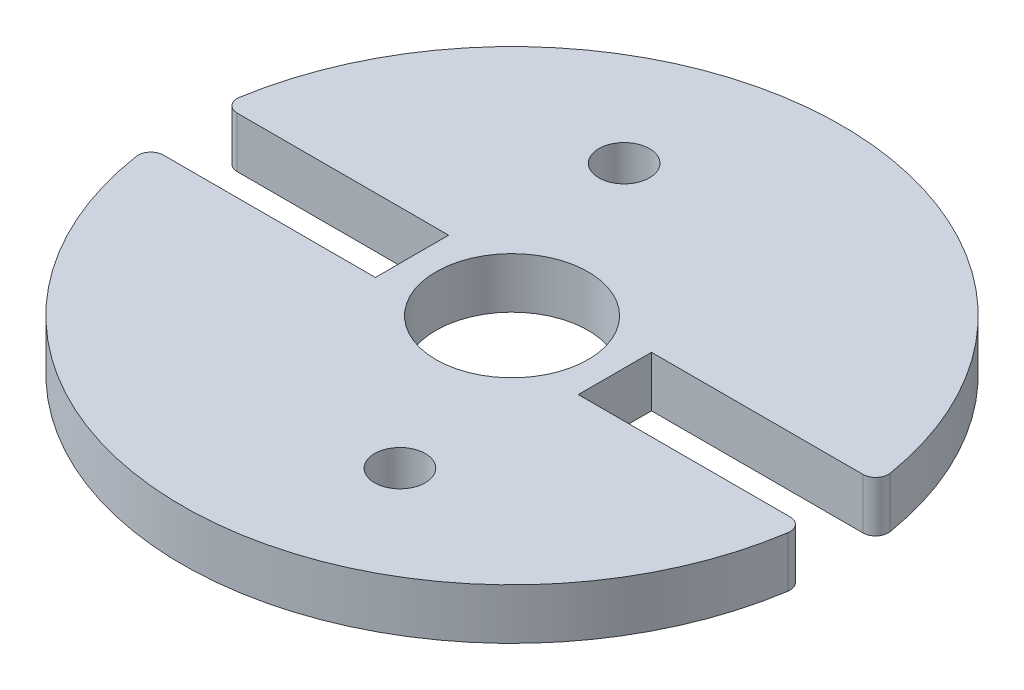
ISO-10303-21;
HEADER;
FILE_DESCRIPTION(('STEP AP214'),'2;1');
FILE_NAME('part.step','',(''),(''),'','','');
FILE_SCHEMA(('AUTOMOTIVE_DESIGN { 1 0 10303 214 1 1 1 1 }'));
ENDSEC;
DATA;
#1=APPLICATION_CONTEXT('core data for automotive mechanical design processes');
#2=APPLICATION_PROTOCOL_DEFINITION('international standard','automotive_design',2000,#1);
#3=PRODUCT_CONTEXT('',#1,'mechanical');
#4=PRODUCT('Part','Part','',(#3));
#5=PRODUCT_RELATED_PRODUCT_CATEGORY('part','',(#4));
#6=PRODUCT_DEFINITION_FORMATION('','',#4);
#7=PRODUCT_DEFINITION_CONTEXT('part definition',#1,'design');
#8=PRODUCT_DEFINITION('design','',#6,#7);
#9=PRODUCT_DEFINITION_SHAPE('','',#8);
#10=(LENGTH_UNIT() NAMED_UNIT(*) SI_UNIT(.MILLI.,.METRE.));
#11=(NAMED_UNIT(*) PLANE_ANGLE_UNIT() SI_UNIT($,.RADIAN.));
#12=(NAMED_UNIT(*) SI_UNIT($,.STERADIAN.) SOLID_ANGLE_UNIT());
#13=UNCERTAINTY_MEASURE_WITH_UNIT(LENGTH_MEASURE(1.E-05),#10,'distance_accuracy_value','');
#14=(GEOMETRIC_REPRESENTATION_CONTEXT(3) GLOBAL_UNCERTAINTY_ASSIGNED_CONTEXT((#13)) GLOBAL_UNIT_ASSIGNED_CONTEXT((#10,
#11,#12)) REPRESENTATION_CONTEXT('',''));
#15=CARTESIAN_POINT('',(0.,0.,0.));
#16=DIRECTION('',(0.,0.,1.));
#17=DIRECTION('',(1.,0.,0.));
#18=AXIS2_PLACEMENT_3D('',#15,#16,#17);
#19=CARTESIAN_POINT('',(-12.3565883381929,2.,1.88804783849236));
#20=DIRECTION('',(0.,-1.,0.));
#21=DIRECTION('',(0.,0.,-1.));
#22=AXIS2_PLACEMENT_3D('',#19,#20,#21);
#23=PLANE('',#22);
#24=CARTESIAN_POINT('',(2.99685274732746,2.,7.41747083653423));
#25=DIRECTION('',(0.,1.,0.));
#26=DIRECTION('',(0.,0.,-1.));
#27=AXIS2_PLACEMENT_3D('',#24,#25,#26);
#28=CIRCLE('',#27,1.);
#29=CARTESIAN_POINT('',(2.99685274732746,2.,6.41747083653423));
#30=VERTEX_POINT('',#29);
#31=EDGE_CURVE('E287',#30,#30,#28,.T.);
#32=ORIENTED_EDGE('',*,*,#31,.F.);
#33=EDGE_LOOP('',(#32));
#34=FACE_BOUND('',#33,.T.);
#35=DIRECTION('',(0.,0.,1.));
#36=VECTOR('',#35,1.);
#37=CARTESIAN_POINT('',(-4.,2.,-1.5));
#38=LINE('',#37,#36);
#39=CARTESIAN_POINT('',(-4.,2.,-1.5));
#40=VERTEX_POINT('',#39);
#41=CARTESIAN_POINT('',(-4.,2.,1.38804783849236));
#42=VERTEX_POINT('',#41);
#43=EDGE_CURVE('E177',#40,#42,#38,.T.);
#44=ORIENTED_EDGE('',*,*,#43,.T.);
#45=DIRECTION('',(-1.,0.,0.));
#46=VECTOR('',#45,1.);
#47=CARTESIAN_POINT('',(-12.3565883381929,2.,1.38804783849236));
#48=LINE('',#47,#46);
#49=CARTESIAN_POINT('',(-12.3565883381929,2.,1.38804783849236));
#50=VERTEX_POINT('',#49);
#51=EDGE_CURVE('E105',#42,#50,#48,.T.);
#52=ORIENTED_EDGE('',*,*,#51,.T.);
#53=CARTESIAN_POINT('',(-12.3565883381929,2.,1.88804783849236));
#54=DIRECTION('',(0.,1.,0.));
#55=DIRECTION('',(0.,0.,-1.));
#56=AXIS2_PLACEMENT_3D('',#53,#54,#55);
#57=CIRCLE('',#56,0.5);
#58=CARTESIAN_POINT('',(-12.8508518717206,2.,1.96356975203205));
#59=VERTEX_POINT('',#58);
#60=EDGE_CURVE('E204',#50,#59,#57,.T.);
#61=ORIENTED_EDGE('',*,*,#60,.T.);
#62=CARTESIAN_POINT('',(0.,2.,0.));
#63=DIRECTION('',(0.,1.,0.));
#64=DIRECTION('',(0.,0.,1.));
#65=AXIS2_PLACEMENT_3D('',#62,#63,#64);
#66=CIRCLE('',#65,13.);
#67=CARTESIAN_POINT('',(12.8508518717206,2.,1.96356975203206));
#68=VERTEX_POINT('',#67);
#69=EDGE_CURVE('E223',#59,#68,#66,.T.);
#70=ORIENTED_EDGE('',*,*,#69,.T.);
#71=CARTESIAN_POINT('',(12.3565883381929,2.,1.88804783849236));
#72=DIRECTION('',(0.,1.,0.));
#73=DIRECTION('',(0.,0.,1.));
#74=AXIS2_PLACEMENT_3D('',#71,#72,#73);
#75=CIRCLE('',#74,0.5);
#76=CARTESIAN_POINT('',(12.3565883381929,2.,1.38804783849236));
#77=VERTEX_POINT('',#76);
#78=EDGE_CURVE('E220',#68,#77,#75,.T.);
#79=ORIENTED_EDGE('',*,*,#78,.T.);
#80=DIRECTION('',(-1.,0.,0.));
#81=VECTOR('',#80,1.);
#82=CARTESIAN_POINT('',(12.3565883381929,2.,1.38804783849236));
#83=LINE('',#82,#81);
#84=CARTESIAN_POINT('',(4.,2.,1.38804783849236));
#85=VERTEX_POINT('',#84);
#86=EDGE_CURVE('E222',#77,#85,#83,.T.);
#87=ORIENTED_EDGE('',*,*,#86,.T.);
#88=DIRECTION('',(0.,0.,-1.));
#89=VECTOR('',#88,1.);
#90=CARTESIAN_POINT('',(4.,2.,-1.5));
#91=LINE('',#90,#89);
#92=CARTESIAN_POINT('',(4.,2.,-1.5));
#93=VERTEX_POINT('',#92);
#94=EDGE_CURVE('E225',#85,#93,#91,.T.);
#95=ORIENTED_EDGE('',*,*,#94,.T.);
#96=DIRECTION('',(1.,0.,0.));
#97=VECTOR('',#96,1.);
#98=CARTESIAN_POINT('',(12.3389626792531,2.,-1.5));
#99=LINE('',#98,#97);
#100=CARTESIAN_POINT('',(12.3389626792531,2.,-1.5));
#101=VERTEX_POINT('',#100);
#102=EDGE_CURVE('E231',#93,#101,#99,.T.);
#103=ORIENTED_EDGE('',*,*,#102,.T.);
#104=CARTESIAN_POINT('',(12.3389626792531,2.,-2.));
#105=DIRECTION('',(0.,1.,0.));
#106=DIRECTION('',(0.,0.,-1.));
#107=AXIS2_PLACEMENT_3D('',#104,#105,#106);
#108=CIRCLE('',#107,0.5);
#109=CARTESIAN_POINT('',(12.8325211864232,2.,-2.08));
#110=VERTEX_POINT('',#109);
#111=EDGE_CURVE('E136',#101,#110,#108,.T.);
#112=ORIENTED_EDGE('',*,*,#111,.T.);
#113=CARTESIAN_POINT('',(0.,2.,0.));
#114=DIRECTION('',(0.,1.,0.));
#115=DIRECTION('',(0.,0.,1.));
#116=AXIS2_PLACEMENT_3D('',#113,#114,#115);
#117=CIRCLE('',#116,13.);
#118=CARTESIAN_POINT('',(-12.8325211864232,2.,-2.08));
#119=VERTEX_POINT('',#118);
#120=EDGE_CURVE('E130',#110,#119,#117,.T.);
#121=ORIENTED_EDGE('',*,*,#120,.T.);
#122=CARTESIAN_POINT('',(-12.3389626792531,2.,-2.));
#123=DIRECTION('',(0.,1.,0.));
#124=DIRECTION('',(0.,0.,1.));
#125=AXIS2_PLACEMENT_3D('',#122,#123,#124);
#126=CIRCLE('',#125,0.5);
#127=CARTESIAN_POINT('',(-12.3389626792531,2.,-1.5));
#128=VERTEX_POINT('',#127);
#129=EDGE_CURVE('E134',#119,#128,#126,.T.);
#130=ORIENTED_EDGE('',*,*,#129,.T.);
#131=DIRECTION('',(1.,0.,0.));
#132=VECTOR('',#131,1.);
#133=CARTESIAN_POINT('',(-12.3389626792531,2.,-1.5));
#134=LINE('',#133,#132);
#135=EDGE_CURVE('E50',#128,#40,#134,.T.);
#136=ORIENTED_EDGE('',*,*,#135,.T.);
#137=EDGE_LOOP('',(#44,#52,#61,#70,#79,#87,#95,#103,#112,#121,#130,#136));
#138=FACE_BOUND('',#137,.T.);
#139=CARTESIAN_POINT('',(-2.99685274732731,2.,-7.4174708365343));
#140=DIRECTION('',(0.,1.,0.));
#141=DIRECTION('',(0.,0.,1.));
#142=AXIS2_PLACEMENT_3D('',#139,#140,#141);
#143=CIRCLE('',#142,1.);
#144=CARTESIAN_POINT('',(-2.99685274732731,2.,-6.4174708365343));
#145=VERTEX_POINT('',#144);
#146=EDGE_CURVE('E158',#145,#145,#143,.T.);
#147=ORIENTED_EDGE('',*,*,#146,.F.);
#148=EDGE_LOOP('',(#147));
#149=FACE_BOUND('',#148,.T.);
#150=CARTESIAN_POINT('',(0.,2.,0.));
#151=DIRECTION('',(0.,1.,0.));
#152=DIRECTION('',(0.,0.,1.));
#153=AXIS2_PLACEMENT_3D('',#150,#151,#152);
#154=CIRCLE('',#153,3.);
#155=CARTESIAN_POINT('',(0.,2.,3.));
#156=VERTEX_POINT('',#155);
#157=EDGE_CURVE('E278',#156,#156,#154,.T.);
#158=ORIENTED_EDGE('',*,*,#157,.F.);
#159=EDGE_LOOP('',(#158));
#160=FACE_BOUND('',#159,.T.);
#161=ADVANCED_FACE('F33',(#34,#138,#149,#160),#23,.F.);
#162=CARTESIAN_POINT('',(-12.3565883381929,0.,1.88804783849236));
#163=DIRECTION('',(0.,-1.,0.));
#164=DIRECTION('',(0.,0.,-1.));
#165=AXIS2_PLACEMENT_3D('',#162,#163,#164);
#166=PLANE('',#165);
#167=CARTESIAN_POINT('',(2.99685274732746,0.,7.41747083653423));
#168=DIRECTION('',(0.,1.,0.));
#169=DIRECTION('',(0.,0.,-1.));
#170=AXIS2_PLACEMENT_3D('',#167,#168,#169);
#171=CIRCLE('',#170,1.);
#172=CARTESIAN_POINT('',(2.99685274732746,0.,6.41747083653423));
#173=VERTEX_POINT('',#172);
#174=EDGE_CURVE('E284',#173,#173,#171,.T.);
#175=ORIENTED_EDGE('',*,*,#174,.T.);
#176=EDGE_LOOP('',(#175));
#177=FACE_BOUND('',#176,.T.);
#178=DIRECTION('',(0.,0.,1.));
#179=VECTOR('',#178,1.);
#180=CARTESIAN_POINT('',(-4.,0.,-1.5));
#181=LINE('',#180,#179);
#182=CARTESIAN_POINT('',(-4.,0.,-1.5));
#183=VERTEX_POINT('',#182);
#184=CARTESIAN_POINT('',(-4.,0.,1.38804783849236));
#185=VERTEX_POINT('',#184);
#186=EDGE_CURVE('E154',#183,#185,#181,.T.);
#187=ORIENTED_EDGE('',*,*,#186,.F.);
#188=DIRECTION('',(1.,0.,0.));
#189=VECTOR('',#188,1.);
#190=CARTESIAN_POINT('',(-12.3389626792531,0.,-1.5));
#191=LINE('',#190,#189);
#192=CARTESIAN_POINT('',(-12.3389626792531,0.,-1.5));
#193=VERTEX_POINT('',#192);
#194=EDGE_CURVE('E97',#193,#183,#191,.T.);
#195=ORIENTED_EDGE('',*,*,#194,.F.);
#196=CARTESIAN_POINT('',(-12.3389626792531,0.,-2.));
#197=DIRECTION('',(0.,1.,0.));
#198=DIRECTION('',(0.,0.,1.));
#199=AXIS2_PLACEMENT_3D('',#196,#197,#198);
#200=CIRCLE('',#199,0.5);
#201=CARTESIAN_POINT('',(-12.8325211864232,0.,-2.08));
#202=VERTEX_POINT('',#201);
#203=EDGE_CURVE('E91',#202,#193,#200,.T.);
#204=ORIENTED_EDGE('',*,*,#203,.F.);
#205=CARTESIAN_POINT('',(0.,0.,0.));
#206=DIRECTION('',(0.,1.,0.));
#207=DIRECTION('',(0.,0.,1.));
#208=AXIS2_PLACEMENT_3D('',#205,#206,#207);
#209=CIRCLE('',#208,13.);
#210=CARTESIAN_POINT('',(12.8325211864232,0.,-2.08));
#211=VERTEX_POINT('',#210);
#212=EDGE_CURVE('E144',#211,#202,#209,.T.);
#213=ORIENTED_EDGE('',*,*,#212,.F.);
#214=CARTESIAN_POINT('',(12.3389626792531,0.,-2.));
#215=DIRECTION('',(0.,1.,0.));
#216=DIRECTION('',(0.,0.,-1.));
#217=AXIS2_PLACEMENT_3D('',#214,#215,#216);
#218=CIRCLE('',#217,0.5);
#219=CARTESIAN_POINT('',(12.3389626792531,0.,-1.5));
#220=VERTEX_POINT('',#219);
#221=EDGE_CURVE('E172',#220,#211,#218,.T.);
#222=ORIENTED_EDGE('',*,*,#221,.F.);
#223=DIRECTION('',(1.,0.,0.));
#224=VECTOR('',#223,1.);
#225=CARTESIAN_POINT('',(12.3389626792531,0.,-1.5));
#226=LINE('',#225,#224);
#227=CARTESIAN_POINT('',(4.,0.,-1.5));
#228=VERTEX_POINT('',#227);
#229=EDGE_CURVE('E170',#228,#220,#226,.T.);
#230=ORIENTED_EDGE('',*,*,#229,.F.);
#231=DIRECTION('',(0.,0.,-1.));
#232=VECTOR('',#231,1.);
#233=CARTESIAN_POINT('',(4.,0.,-1.5));
#234=LINE('',#233,#232);
#235=CARTESIAN_POINT('',(4.,0.,1.38804783849236));
#236=VERTEX_POINT('',#235);
#237=EDGE_CURVE('E168',#236,#228,#234,.T.);
#238=ORIENTED_EDGE('',*,*,#237,.F.);
#239=DIRECTION('',(-1.,0.,0.));
#240=VECTOR('',#239,1.);
#241=CARTESIAN_POINT('',(12.3565883381929,0.,1.38804783849236));
#242=LINE('',#241,#240);
#243=CARTESIAN_POINT('',(12.3565883381929,0.,1.38804783849236));
#244=VERTEX_POINT('',#243);
#245=EDGE_CURVE('E166',#244,#236,#242,.T.);
#246=ORIENTED_EDGE('',*,*,#245,.F.);
#247=CARTESIAN_POINT('',(12.3565883381929,0.,1.88804783849236));
#248=DIRECTION('',(0.,1.,0.));
#249=DIRECTION('',(0.,0.,1.));
#250=AXIS2_PLACEMENT_3D('',#247,#248,#249);
#251=CIRCLE('',#250,0.5);
#252=CARTESIAN_POINT('',(12.8508518717206,0.,1.96356975203206));
#253=VERTEX_POINT('',#252);
#254=EDGE_CURVE('E164',#253,#244,#251,.T.);
#255=ORIENTED_EDGE('',*,*,#254,.F.);
#256=CARTESIAN_POINT('',(0.,0.,0.));
#257=DIRECTION('',(0.,1.,0.));
#258=DIRECTION('',(0.,0.,1.));
#259=AXIS2_PLACEMENT_3D('',#256,#257,#258);
#260=CIRCLE('',#259,13.);
#261=CARTESIAN_POINT('',(-12.8508518717206,0.,1.96356975203205));
#262=VERTEX_POINT('',#261);
#263=EDGE_CURVE('E162',#262,#253,#260,.T.);
#264=ORIENTED_EDGE('',*,*,#263,.F.);
#265=CARTESIAN_POINT('',(-12.3565883381929,0.,1.88804783849236));
#266=DIRECTION('',(0.,1.,0.));
#267=DIRECTION('',(0.,0.,-1.));
#268=AXIS2_PLACEMENT_3D('',#265,#266,#267);
#269=CIRCLE('',#268,0.5);
#270=CARTESIAN_POINT('',(-12.3565883381929,0.,1.38804783849236));
#271=VERTEX_POINT('',#270);
#272=EDGE_CURVE('E160',#271,#262,#269,.T.);
#273=ORIENTED_EDGE('',*,*,#272,.F.);
#274=DIRECTION('',(-1.,0.,0.));
#275=VECTOR('',#274,1.);
#276=CARTESIAN_POINT('',(-12.3565883381929,0.,1.38804783849236));
#277=LINE('',#276,#275);
#278=EDGE_CURVE('E157',#185,#271,#277,.T.);
#279=ORIENTED_EDGE('',*,*,#278,.F.);
#280=EDGE_LOOP('',(#187,#195,#204,#213,#222,#230,#238,#246,#255,#264,#273,#279));
#281=FACE_BOUND('',#280,.T.);
#282=CARTESIAN_POINT('',(-2.99685274732731,0.,-7.4174708365343));
#283=DIRECTION('',(0.,1.,0.));
#284=DIRECTION('',(0.,0.,1.));
#285=AXIS2_PLACEMENT_3D('',#282,#283,#284);
#286=CIRCLE('',#285,1.);
#287=CARTESIAN_POINT('',(-2.99685274732731,0.,-6.4174708365343));
#288=VERTEX_POINT('',#287);
#289=EDGE_CURVE('E290',#288,#288,#286,.T.);
#290=ORIENTED_EDGE('',*,*,#289,.T.);
#291=EDGE_LOOP('',(#290));
#292=FACE_BOUND('',#291,.T.);
#293=CARTESIAN_POINT('',(0.,0.,0.));
#294=DIRECTION('',(0.,1.,0.));
#295=DIRECTION('',(0.,0.,1.));
#296=AXIS2_PLACEMENT_3D('',#293,#294,#295);
#297=CIRCLE('',#296,3.);
#298=CARTESIAN_POINT('',(0.,0.,3.));
#299=VERTEX_POINT('',#298);
#300=EDGE_CURVE('E281',#299,#299,#297,.T.);
#301=ORIENTED_EDGE('',*,*,#300,.T.);
#302=EDGE_LOOP('',(#301));
#303=FACE_BOUND('',#302,.T.);
#304=ADVANCED_FACE('F208',(#177,#281,#292,#303),#166,.T.);
#305=CARTESIAN_POINT('',(-4.,2.,-1.5));
#306=DIRECTION('',(1.,0.,0.));
#307=DIRECTION('',(0.,0.,-1.));
#308=AXIS2_PLACEMENT_3D('',#305,#306,#307);
#309=PLANE('',#308);
#310=ORIENTED_EDGE('',*,*,#186,.T.);
#311=DIRECTION('',(0.,-1.,0.));
#312=VECTOR('',#311,1.);
#313=CARTESIAN_POINT('',(-4.,2.,1.38804783849236));
#314=LINE('',#313,#312);
#315=EDGE_CURVE('E11',#42,#185,#314,.T.);
#316=ORIENTED_EDGE('',*,*,#315,.F.);
#317=ORIENTED_EDGE('',*,*,#43,.F.);
#318=DIRECTION('',(0.,-1.,0.));
#319=VECTOR('',#318,1.);
#320=CARTESIAN_POINT('',(-4.,2.,-1.5));
#321=LINE('',#320,#319);
#322=EDGE_CURVE('E150',#40,#183,#321,.T.);
#323=ORIENTED_EDGE('',*,*,#322,.T.);
#324=EDGE_LOOP('',(#310,#316,#317,#323));
#325=FACE_BOUND('',#324,.T.);
#326=ADVANCED_FACE('F35',(#325),#309,.F.);
#327=CARTESIAN_POINT('',(-12.3565883381929,2.,1.38804783849236));
#328=DIRECTION('',(0.,0.,1.));
#329=DIRECTION('',(1.,0.,0.));
#330=AXIS2_PLACEMENT_3D('',#327,#328,#329);
#331=PLANE('',#330);
#332=ORIENTED_EDGE('',*,*,#278,.T.);
#333=DIRECTION('',(0.,-1.,0.));
#334=VECTOR('',#333,1.);
#335=CARTESIAN_POINT('',(-12.3565883381929,2.,1.38804783849236));
#336=LINE('',#335,#334);
#337=EDGE_CURVE('E42',#50,#271,#336,.T.);
#338=ORIENTED_EDGE('',*,*,#337,.F.);
#339=ORIENTED_EDGE('',*,*,#51,.F.);
#340=ORIENTED_EDGE('',*,*,#315,.T.);
#341=EDGE_LOOP('',(#332,#338,#339,#340));
#342=FACE_BOUND('',#341,.T.);
#343=ADVANCED_FACE('F391',(#342),#331,.F.);
#344=CARTESIAN_POINT('',(-12.3565883381929,2.,1.88804783849236));
#345=DIRECTION('',(0.,-1.,0.));
#346=DIRECTION('',(0.,0.,-1.));
#347=AXIS2_PLACEMENT_3D('',#344,#345,#346);
#348=CYLINDRICAL_SURFACE('',#347,0.5);
#349=ORIENTED_EDGE('',*,*,#272,.T.);
#350=DIRECTION('',(0.,-1.,0.));
#351=VECTOR('',#350,1.);
#352=CARTESIAN_POINT('',(-12.8508518717206,2.,1.96356975203205));
#353=LINE('',#352,#351);
#354=EDGE_CURVE('E196',#59,#262,#353,.T.);
#355=ORIENTED_EDGE('',*,*,#354,.F.);
#356=ORIENTED_EDGE('',*,*,#60,.F.);
#357=ORIENTED_EDGE('',*,*,#337,.T.);
#358=EDGE_LOOP('',(#349,#355,#356,#357));
#359=FACE_BOUND('',#358,.T.);
#360=ADVANCED_FACE('F202',(#359),#348,.T.);
#361=CARTESIAN_POINT('',(0.,2.,0.));
#362=DIRECTION('',(0.,-1.,0.));
#363=DIRECTION('',(0.,0.,-1.));
#364=AXIS2_PLACEMENT_3D('',#361,#362,#363);
#365=CYLINDRICAL_SURFACE('',#364,13.);
#366=ORIENTED_EDGE('',*,*,#263,.T.);
#367=DIRECTION('',(0.,-1.,0.));
#368=VECTOR('',#367,1.);
#369=CARTESIAN_POINT('',(12.8508518717206,2.,1.96356975203206));
#370=LINE('',#369,#368);
#371=EDGE_CURVE('E193',#68,#253,#370,.T.);
#372=ORIENTED_EDGE('',*,*,#371,.F.);
#373=ORIENTED_EDGE('',*,*,#69,.F.);
#374=ORIENTED_EDGE('',*,*,#354,.T.);
#375=EDGE_LOOP('',(#366,#372,#373,#374));
#376=FACE_BOUND('',#375,.T.);
#377=ADVANCED_FACE('F214',(#376),#365,.T.);
#378=CARTESIAN_POINT('',(12.3565883381929,2.,1.88804783849236));
#379=DIRECTION('',(0.,-1.,0.));
#380=DIRECTION('',(0.,0.,-1.));
#381=AXIS2_PLACEMENT_3D('',#378,#379,#380);
#382=CYLINDRICAL_SURFACE('',#381,0.5);
#383=ORIENTED_EDGE('',*,*,#254,.T.);
#384=DIRECTION('',(0.,-1.,0.));
#385=VECTOR('',#384,1.);
#386=CARTESIAN_POINT('',(12.3565883381929,2.,1.38804783849236));
#387=LINE('',#386,#385);
#388=EDGE_CURVE('E190',#77,#244,#387,.T.);
#389=ORIENTED_EDGE('',*,*,#388,.F.);
#390=ORIENTED_EDGE('',*,*,#78,.F.);
#391=ORIENTED_EDGE('',*,*,#371,.T.);
#392=EDGE_LOOP('',(#383,#389,#390,#391));
#393=FACE_BOUND('',#392,.T.);
#394=ADVANCED_FACE('F218',(#393),#382,.T.);
#395=CARTESIAN_POINT('',(12.3565883381929,2.,1.38804783849236));
#396=DIRECTION('',(0.,0.,1.));
#397=DIRECTION('',(1.,0.,0.));
#398=AXIS2_PLACEMENT_3D('',#395,#396,#397);
#399=PLANE('',#398);
#400=ORIENTED_EDGE('',*,*,#245,.T.);
#401=DIRECTION('',(0.,-1.,0.));
#402=VECTOR('',#401,1.);
#403=CARTESIAN_POINT('',(4.,2.,1.38804783849236));
#404=LINE('',#403,#402);
#405=EDGE_CURVE('E187',#85,#236,#404,.T.);
#406=ORIENTED_EDGE('',*,*,#405,.F.);
#407=ORIENTED_EDGE('',*,*,#86,.F.);
#408=ORIENTED_EDGE('',*,*,#388,.T.);
#409=EDGE_LOOP('',(#400,#406,#407,#408));
#410=FACE_BOUND('',#409,.T.);
#411=ADVANCED_FACE('F356',(#410),#399,.F.);
#412=CARTESIAN_POINT('',(4.,2.,-1.5));
#413=DIRECTION('',(-1.,0.,0.));
#414=DIRECTION('',(0.,0.,1.));
#415=AXIS2_PLACEMENT_3D('',#412,#413,#414);
#416=PLANE('',#415);
#417=ORIENTED_EDGE('',*,*,#237,.T.);
#418=DIRECTION('',(0.,-1.,0.));
#419=VECTOR('',#418,1.);
#420=CARTESIAN_POINT('',(4.,2.,-1.5));
#421=LINE('',#420,#419);
#422=EDGE_CURVE('E184',#93,#228,#421,.T.);
#423=ORIENTED_EDGE('',*,*,#422,.F.);
#424=ORIENTED_EDGE('',*,*,#94,.F.);
#425=ORIENTED_EDGE('',*,*,#405,.T.);
#426=EDGE_LOOP('',(#417,#423,#424,#425));
#427=FACE_BOUND('',#426,.T.);
#428=ADVANCED_FACE('F347',(#427),#416,.F.);
#429=CARTESIAN_POINT('',(12.3389626792531,2.,-1.5));
#430=DIRECTION('',(0.,0.,-1.));
#431=DIRECTION('',(-1.,0.,0.));
#432=AXIS2_PLACEMENT_3D('',#429,#430,#431);
#433=PLANE('',#432);
#434=ORIENTED_EDGE('',*,*,#229,.T.);
#435=DIRECTION('',(0.,-1.,0.));
#436=VECTOR('',#435,1.);
#437=CARTESIAN_POINT('',(12.3389626792531,2.,-1.5));
#438=LINE('',#437,#436);
#439=EDGE_CURVE('E181',#101,#220,#438,.T.);
#440=ORIENTED_EDGE('',*,*,#439,.F.);
#441=ORIENTED_EDGE('',*,*,#102,.F.);
#442=ORIENTED_EDGE('',*,*,#422,.T.);
#443=EDGE_LOOP('',(#434,#440,#441,#442));
#444=FACE_BOUND('',#443,.T.);
#445=ADVANCED_FACE('F237',(#444),#433,.F.);
#446=CARTESIAN_POINT('',(12.3389626792531,2.,-2.));
#447=DIRECTION('',(0.,-1.,0.));
#448=DIRECTION('',(0.,0.,-1.));
#449=AXIS2_PLACEMENT_3D('',#446,#447,#448);
#450=CYLINDRICAL_SURFACE('',#449,0.5);
#451=ORIENTED_EDGE('',*,*,#221,.T.);
#452=DIRECTION('',(0.,-1.,0.));
#453=VECTOR('',#452,1.);
#454=CARTESIAN_POINT('',(12.8325211864232,2.,-2.08));
#455=LINE('',#454,#453);
#456=EDGE_CURVE('E145',#110,#211,#455,.T.);
#457=ORIENTED_EDGE('',*,*,#456,.F.);
#458=ORIENTED_EDGE('',*,*,#111,.F.);
#459=ORIENTED_EDGE('',*,*,#439,.T.);
#460=EDGE_LOOP('',(#451,#457,#458,#459));
#461=FACE_BOUND('',#460,.T.);
#462=ADVANCED_FACE('F241',(#461),#450,.T.);
#463=CARTESIAN_POINT('',(0.,2.,0.));
#464=DIRECTION('',(0.,-1.,0.));
#465=DIRECTION('',(0.,0.,-1.));
#466=AXIS2_PLACEMENT_3D('',#463,#464,#465);
#467=CYLINDRICAL_SURFACE('',#466,13.);
#468=ORIENTED_EDGE('',*,*,#212,.T.);
#469=DIRECTION('',(0.,-1.,0.));
#470=VECTOR('',#469,1.);
#471=CARTESIAN_POINT('',(-12.8325211864232,2.,-2.08));
#472=LINE('',#471,#470);
#473=EDGE_CURVE('E141',#119,#202,#472,.T.);
#474=ORIENTED_EDGE('',*,*,#473,.F.);
#475=ORIENTED_EDGE('',*,*,#120,.F.);
#476=ORIENTED_EDGE('',*,*,#456,.T.);
#477=EDGE_LOOP('',(#468,#474,#475,#476));
#478=FACE_BOUND('',#477,.T.);
#479=ADVANCED_FACE('F142',(#478),#467,.T.);
#480=CARTESIAN_POINT('',(-12.3389626792531,2.,-2.));
#481=DIRECTION('',(0.,-1.,0.));
#482=DIRECTION('',(0.,0.,-1.));
#483=AXIS2_PLACEMENT_3D('',#480,#481,#482);
#484=CYLINDRICAL_SURFACE('',#483,0.5);
#485=ORIENTED_EDGE('',*,*,#203,.T.);
#486=DIRECTION('',(0.,-1.,0.));
#487=VECTOR('',#486,1.);
#488=CARTESIAN_POINT('',(-12.3389626792531,2.,-1.5));
#489=LINE('',#488,#487);
#490=EDGE_CURVE('E146',#128,#193,#489,.T.);
#491=ORIENTED_EDGE('',*,*,#490,.F.);
#492=ORIENTED_EDGE('',*,*,#129,.F.);
#493=ORIENTED_EDGE('',*,*,#473,.T.);
#494=EDGE_LOOP('',(#485,#491,#492,#493));
#495=FACE_BOUND('',#494,.T.);
#496=ADVANCED_FACE('F148',(#495),#484,.T.);
#497=CARTESIAN_POINT('',(-12.3389626792531,2.,-1.5));
#498=DIRECTION('',(0.,0.,-1.));
#499=DIRECTION('',(-1.,0.,0.));
#500=AXIS2_PLACEMENT_3D('',#497,#498,#499);
#501=PLANE('',#500);
#502=ORIENTED_EDGE('',*,*,#194,.T.);
#503=ORIENTED_EDGE('',*,*,#322,.F.);
#504=ORIENTED_EDGE('',*,*,#135,.F.);
#505=ORIENTED_EDGE('',*,*,#490,.T.);
#506=EDGE_LOOP('',(#502,#503,#504,#505));
#507=FACE_BOUND('',#506,.T.);
#508=ADVANCED_FACE('F245',(#507),#501,.F.);
#509=CARTESIAN_POINT('',(-2.99685274732731,2.,-7.4174708365343));
#510=DIRECTION('',(0.,-1.,0.));
#511=DIRECTION('',(0.,0.,-1.));
#512=AXIS2_PLACEMENT_3D('',#509,#510,#511);
#513=CYLINDRICAL_SURFACE('',#512,1.);
#514=ORIENTED_EDGE('',*,*,#146,.T.);
#515=EDGE_LOOP('',(#514));
#516=FACE_BOUND('',#515,.T.);
#517=ORIENTED_EDGE('',*,*,#289,.F.);
#518=EDGE_LOOP('',(#517));
#519=FACE_BOUND('',#518,.T.);
#520=ADVANCED_FACE('F247',(#516,#519),#513,.F.);
#521=CARTESIAN_POINT('',(2.99685274732746,2.,7.41747083653423));
#522=DIRECTION('',(0.,-1.,0.));
#523=DIRECTION('',(0.,0.,-1.));
#524=AXIS2_PLACEMENT_3D('',#521,#522,#523);
#525=CYLINDRICAL_SURFACE('',#524,1.);
#526=ORIENTED_EDGE('',*,*,#31,.T.);
#527=EDGE_LOOP('',(#526));
#528=FACE_BOUND('',#527,.T.);
#529=ORIENTED_EDGE('',*,*,#174,.F.);
#530=EDGE_LOOP('',(#529));
#531=FACE_BOUND('',#530,.T.);
#532=ADVANCED_FACE('F253',(#528,#531),#525,.F.);
#533=CARTESIAN_POINT('',(0.,2.,0.));
#534=DIRECTION('',(0.,-1.,0.));
#535=DIRECTION('',(0.,0.,-1.));
#536=AXIS2_PLACEMENT_3D('',#533,#534,#535);
#537=CYLINDRICAL_SURFACE('',#536,3.);
#538=ORIENTED_EDGE('',*,*,#157,.T.);
#539=EDGE_LOOP('',(#538));
#540=FACE_BOUND('',#539,.T.);
#541=ORIENTED_EDGE('',*,*,#300,.F.);
#542=EDGE_LOOP('',(#541));
#543=FACE_BOUND('',#542,.T.);
#544=ADVANCED_FACE('F269',(#540,#543),#537,.F.);
#545=CLOSED_SHELL('',(#161,#304,#326,#343,#360,#377,#394,#411,#428,#445,#462,#479,#496,#508,
#520,#532,#544));
#546=MANIFOLD_SOLID_BREP('B2',#545);
#547=ADVANCED_BREP_SHAPE_REPRESENTATION('',(#18,#546),#14);
#548=SHAPE_DEFINITION_REPRESENTATION(#9,#547);
ENDSEC;
END-ISO-10303-21;
